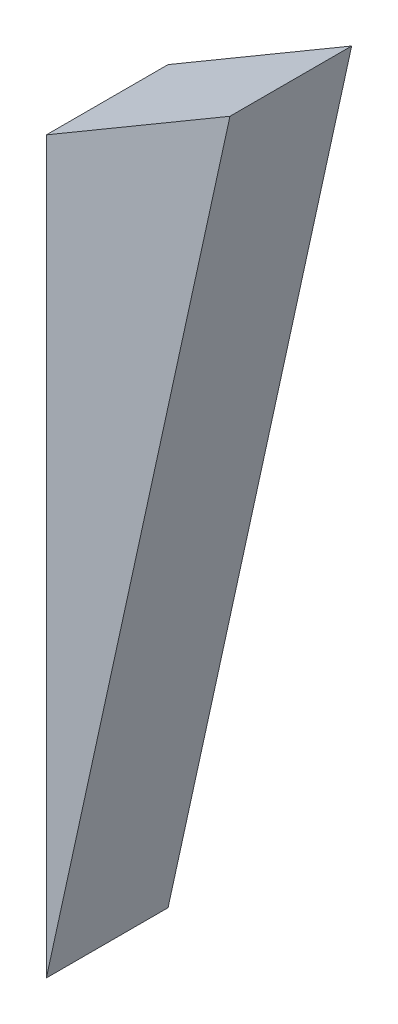
ISO-10303-21;
HEADER;
FILE_DESCRIPTION(('STEP AP214'),'2;1');
FILE_NAME('part.step','',(''),(''),'','','');
FILE_SCHEMA(('AUTOMOTIVE_DESIGN { 1 0 10303 214 1 1 1 1 }'));
ENDSEC;
DATA;
#1=APPLICATION_CONTEXT('core data for automotive mechanical design processes');
#2=APPLICATION_PROTOCOL_DEFINITION('international standard','automotive_design',2000,#1);
#3=PRODUCT_CONTEXT('',#1,'mechanical');
#4=PRODUCT('Part','Part','',(#3));
#5=PRODUCT_RELATED_PRODUCT_CATEGORY('part','',(#4));
#6=PRODUCT_DEFINITION_FORMATION('','',#4);
#7=PRODUCT_DEFINITION_CONTEXT('part definition',#1,'design');
#8=PRODUCT_DEFINITION('design','',#6,#7);
#9=PRODUCT_DEFINITION_SHAPE('','',#8);
#10=(LENGTH_UNIT() NAMED_UNIT(*) SI_UNIT(.MILLI.,.METRE.));
#11=(NAMED_UNIT(*) PLANE_ANGLE_UNIT() SI_UNIT($,.RADIAN.));
#12=(NAMED_UNIT(*) SI_UNIT($,.STERADIAN.) SOLID_ANGLE_UNIT());
#13=UNCERTAINTY_MEASURE_WITH_UNIT(LENGTH_MEASURE(1.E-05),#10,'distance_accuracy_value','');
#14=(GEOMETRIC_REPRESENTATION_CONTEXT(3) GLOBAL_UNCERTAINTY_ASSIGNED_CONTEXT((#13)) GLOBAL_UNIT_ASSIGNED_CONTEXT((#10,
#11,#12)) REPRESENTATION_CONTEXT('',''));
#15=CARTESIAN_POINT('',(0.,0.,0.));
#16=DIRECTION('',(0.,0.,1.));
#17=DIRECTION('',(1.,0.,0.));
#18=AXIS2_PLACEMENT_3D('',#15,#16,#17);
#19=CARTESIAN_POINT('',(3.01749712326108,1.77333333333333,2.));
#20=DIRECTION('',(0.506666666666667,-0.862142035217451,0.));
#21=DIRECTION('',(0.862142035217451,0.506666666666667,0.));
#22=AXIS2_PLACEMENT_3D('',#19,#20,#21);
#23=PLANE('',#22);
#24=DIRECTION('',(-0.862142035217451,-0.506666666666667,0.));
#25=VECTOR('',#24,1.);
#26=CARTESIAN_POINT('',(3.01749712326108,1.77333333333333,0.));
#27=LINE('',#26,#25);
#28=CARTESIAN_POINT('',(3.01749712326108,1.77333333333333,0.));
#29=VERTEX_POINT('',#28);
#30=CARTESIAN_POINT('',(0.,0.,0.));
#31=VERTEX_POINT('',#30);
#32=EDGE_CURVE('E80',#29,#31,#27,.T.);
#33=ORIENTED_EDGE('',*,*,#32,.T.);
#34=DIRECTION('',(0.,0.,-1.));
#35=VECTOR('',#34,1.);
#36=CARTESIAN_POINT('',(0.,0.,2.));
#37=LINE('',#36,#35);
#38=CARTESIAN_POINT('',(0.,0.,2.));
#39=VERTEX_POINT('',#38);
#40=EDGE_CURVE('E11',#39,#31,#37,.T.);
#41=ORIENTED_EDGE('',*,*,#40,.F.);
#42=DIRECTION('',(-0.862142035217451,-0.506666666666667,0.));
#43=VECTOR('',#42,1.);
#44=CARTESIAN_POINT('',(3.01749712326108,1.77333333333333,2.));
#45=LINE('',#44,#43);
#46=CARTESIAN_POINT('',(3.01749712326108,1.77333333333333,2.));
#47=VERTEX_POINT('',#46);
#48=EDGE_CURVE('E73',#47,#39,#45,.T.);
#49=ORIENTED_EDGE('',*,*,#48,.F.);
#50=DIRECTION('',(0.,0.,-1.));
#51=VECTOR('',#50,1.);
#52=CARTESIAN_POINT('',(3.01749712326108,1.77333333333333,2.));
#53=LINE('',#52,#51);
#54=EDGE_CURVE('E81',#47,#29,#53,.T.);
#55=ORIENTED_EDGE('',*,*,#54,.T.);
#56=EDGE_LOOP('',(#33,#41,#49,#55));
#57=FACE_BOUND('',#56,.T.);
#58=ADVANCED_FACE('F33',(#57),#23,.F.);
#59=CARTESIAN_POINT('',(0.,0.,2.));
#60=DIRECTION('',(1.,0.,0.));
#61=DIRECTION('',(0.,0.,-1.));
#62=AXIS2_PLACEMENT_3D('',#59,#60,#61);
#63=PLANE('',#62);
#64=DIRECTION('',(0.,-1.,0.));
#65=VECTOR('',#64,1.);
#66=CARTESIAN_POINT('',(0.,0.,0.));
#67=LINE('',#66,#65);
#68=CARTESIAN_POINT('',(0.,-12.,0.));
#69=VERTEX_POINT('',#68);
#70=EDGE_CURVE('E61',#31,#69,#67,.T.);
#71=ORIENTED_EDGE('',*,*,#70,.T.);
#72=DIRECTION('',(0.,0.,-1.));
#73=VECTOR('',#72,1.);
#74=CARTESIAN_POINT('',(0.,-12.,2.));
#75=LINE('',#74,#73);
#76=CARTESIAN_POINT('',(0.,-12.,2.));
#77=VERTEX_POINT('',#76);
#78=EDGE_CURVE('E41',#77,#69,#75,.T.);
#79=ORIENTED_EDGE('',*,*,#78,.F.);
#80=DIRECTION('',(0.,-1.,0.));
#81=VECTOR('',#80,1.);
#82=CARTESIAN_POINT('',(0.,0.,2.));
#83=LINE('',#82,#81);
#84=EDGE_CURVE('E69',#39,#77,#83,.T.);
#85=ORIENTED_EDGE('',*,*,#84,.F.);
#86=ORIENTED_EDGE('',*,*,#40,.T.);
#87=EDGE_LOOP('',(#71,#79,#85,#86));
#88=FACE_BOUND('',#87,.T.);
#89=ADVANCED_FACE('F70',(#88),#63,.F.);
#90=CARTESIAN_POINT('',(0.,-12.,2.));
#91=DIRECTION('',(-0.976832151300236,0.214006888174544,0.));
#92=DIRECTION('',(-0.214006888174544,-0.976832151300237,0.));
#93=AXIS2_PLACEMENT_3D('',#90,#91,#92);
#94=PLANE('',#93);
#95=DIRECTION('',(0.214006888174544,0.976832151300236,0.));
#96=VECTOR('',#95,1.);
#97=CARTESIAN_POINT('',(0.,-12.,0.));
#98=LINE('',#97,#96);
#99=EDGE_CURVE('E66',#69,#29,#98,.T.);
#100=ORIENTED_EDGE('',*,*,#99,.T.);
#101=ORIENTED_EDGE('',*,*,#54,.F.);
#102=DIRECTION('',(0.214006888174544,0.976832151300236,0.));
#103=VECTOR('',#102,1.);
#104=CARTESIAN_POINT('',(0.,-12.,2.));
#105=LINE('',#104,#103);
#106=EDGE_CURVE('E49',#77,#47,#105,.T.);
#107=ORIENTED_EDGE('',*,*,#106,.F.);
#108=ORIENTED_EDGE('',*,*,#78,.T.);
#109=EDGE_LOOP('',(#100,#101,#107,#108));
#110=FACE_BOUND('',#109,.T.);
#111=ADVANCED_FACE('F88',(#110),#94,.F.);
#112=CARTESIAN_POINT('',(0.,0.,2.));
#113=DIRECTION('',(0.,0.,1.));
#114=DIRECTION('',(1.,0.,0.));
#115=AXIS2_PLACEMENT_3D('',#112,#113,#114);
#116=PLANE('',#115);
#117=ORIENTED_EDGE('',*,*,#48,.T.);
#118=ORIENTED_EDGE('',*,*,#84,.T.);
#119=ORIENTED_EDGE('',*,*,#106,.T.);
#120=EDGE_LOOP('',(#117,#118,#119));
#121=FACE_BOUND('',#120,.T.);
#122=ADVANCED_FACE('F76',(#121),#116,.T.);
#123=CARTESIAN_POINT('',(0.,0.,0.));
#124=DIRECTION('',(0.,0.,1.));
#125=DIRECTION('',(1.,0.,0.));
#126=AXIS2_PLACEMENT_3D('',#123,#124,#125);
#127=PLANE('',#126);
#128=ORIENTED_EDGE('',*,*,#32,.F.);
#129=ORIENTED_EDGE('',*,*,#99,.F.);
#130=ORIENTED_EDGE('',*,*,#70,.F.);
#131=EDGE_LOOP('',(#128,#129,#130));
#132=FACE_BOUND('',#131,.T.);
#133=ADVANCED_FACE('F89',(#132),#127,.F.);
#134=CLOSED_SHELL('',(#58,#89,#111,#122,#133));
#135=MANIFOLD_SOLID_BREP('B2',#134);
#136=ADVANCED_BREP_SHAPE_REPRESENTATION('',(#18,#135),#14);
#137=SHAPE_DEFINITION_REPRESENTATION(#9,#136);
ENDSEC;
END-ISO-10303-21;
